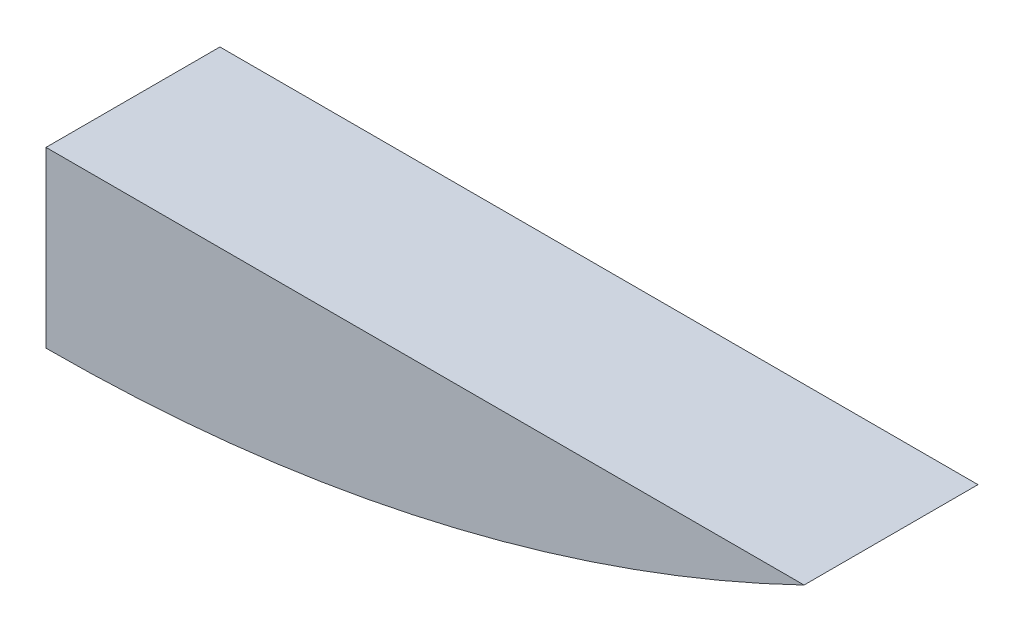
ISO-10303-21;
HEADER;
FILE_DESCRIPTION(('STEP AP214'),'2;1');
FILE_NAME('part.step','',(''),(''),'','','');
FILE_SCHEMA(('AUTOMOTIVE_DESIGN { 1 0 10303 214 1 1 1 1 }'));
ENDSEC;
DATA;
#1=APPLICATION_CONTEXT('core data for automotive mechanical design processes');
#2=APPLICATION_PROTOCOL_DEFINITION('international standard','automotive_design',2000,#1);
#3=PRODUCT_CONTEXT('',#1,'mechanical');
#4=PRODUCT('Part','Part','',(#3));
#5=PRODUCT_RELATED_PRODUCT_CATEGORY('part','',(#4));
#6=PRODUCT_DEFINITION_FORMATION('','',#4);
#7=PRODUCT_DEFINITION_CONTEXT('part definition',#1,'design');
#8=PRODUCT_DEFINITION('design','',#6,#7);
#9=PRODUCT_DEFINITION_SHAPE('','',#8);
#10=(LENGTH_UNIT() NAMED_UNIT(*) SI_UNIT(.MILLI.,.METRE.));
#11=(NAMED_UNIT(*) PLANE_ANGLE_UNIT() SI_UNIT($,.RADIAN.));
#12=(NAMED_UNIT(*) SI_UNIT($,.STERADIAN.) SOLID_ANGLE_UNIT());
#13=UNCERTAINTY_MEASURE_WITH_UNIT(LENGTH_MEASURE(1.E-05),#10,'distance_accuracy_value','');
#14=(GEOMETRIC_REPRESENTATION_CONTEXT(3) GLOBAL_UNCERTAINTY_ASSIGNED_CONTEXT((#13)) GLOBAL_UNIT_ASSIGNED_CONTEXT((#10,
#11,#12)) REPRESENTATION_CONTEXT('',''));
#15=CARTESIAN_POINT('',(0.,0.,0.));
#16=DIRECTION('',(0.,0.,1.));
#17=DIRECTION('',(1.,0.,0.));
#18=AXIS2_PLACEMENT_3D('',#15,#16,#17);
#19=CARTESIAN_POINT('',(0.,-45.,0.));
#20=DIRECTION('',(0.,1.,0.));
#21=DIRECTION('',(0.,0.,1.));
#22=AXIS2_PLACEMENT_3D('',#19,#20,#21);
#23=PLANE('',#22);
#24=DIRECTION('',(0.,0.,1.));
#25=VECTOR('',#24,1.);
#26=CARTESIAN_POINT('',(597.266258042068,-45.,0.));
#27=LINE('',#26,#25);
#28=CARTESIAN_POINT('',(597.266258042068,-45.,0.));
#29=VERTEX_POINT('',#28);
#30=CARTESIAN_POINT('',(597.266258042068,-45.,5.));
#31=VERTEX_POINT('',#30);
#32=EDGE_CURVE('E74',#29,#31,#27,.T.);
#33=ORIENTED_EDGE('',*,*,#32,.T.);
#34=DIRECTION('',(-1.,0.,0.));
#35=VECTOR('',#34,1.);
#36=CARTESIAN_POINT('',(597.266258042068,-45.,5.));
#37=LINE('',#36,#35);
#38=CARTESIAN_POINT('',(619.060752759772,-45.,5.));
#39=VERTEX_POINT('',#38);
#40=EDGE_CURVE('E38',#39,#31,#37,.T.);
#41=ORIENTED_EDGE('',*,*,#40,.F.);
#42=DIRECTION('',(0.,0.,-1.));
#43=VECTOR('',#42,1.);
#44=CARTESIAN_POINT('',(619.060752759772,-45.,80.));
#45=LINE('',#44,#43);
#46=CARTESIAN_POINT('',(619.060752759772,-45.,0.));
#47=VERTEX_POINT('',#46);
#48=EDGE_CURVE('E82',#39,#47,#45,.T.);
#49=ORIENTED_EDGE('',*,*,#48,.T.);
#50=DIRECTION('',(-1.,0.,0.));
#51=VECTOR('',#50,1.);
#52=CARTESIAN_POINT('',(-502.733741957931,-45.,0.));
#53=LINE('',#52,#51);
#54=EDGE_CURVE('E84',#47,#29,#53,.T.);
#55=ORIENTED_EDGE('',*,*,#54,.T.);
#56=EDGE_LOOP('',(#33,#41,#49,#55));
#57=FACE_BOUND('',#56,.T.);
#58=ADVANCED_FACE('F34',(#57),#23,.T.);
#59=CARTESIAN_POINT('',(597.266258042068,0.,80.));
#60=DIRECTION('',(0.,0.,-1.));
#61=DIRECTION('',(-1.,0.,0.));
#62=AXIS2_PLACEMENT_3D('',#59,#60,#61);
#63=CYLINDRICAL_SURFACE('',#62,50.);
#64=ORIENTED_EDGE('',*,*,#48,.F.);
#65=CARTESIAN_POINT('',(597.266258042068,0.,5.));
#66=DIRECTION('',(0.,0.,1.));
#67=DIRECTION('',(1.,0.,0.));
#68=AXIS2_PLACEMENT_3D('',#65,#66,#67);
#69=CIRCLE('',#68,50.);
#70=CARTESIAN_POINT('',(597.266258042068,-50.,5.));
#71=VERTEX_POINT('',#70);
#72=EDGE_CURVE('E11',#71,#39,#69,.T.);
#73=ORIENTED_EDGE('',*,*,#72,.F.);
#74=DIRECTION('',(0.,0.,-1.));
#75=VECTOR('',#74,1.);
#76=CARTESIAN_POINT('',(597.266258042068,-50.,80.));
#77=LINE('',#76,#75);
#78=CARTESIAN_POINT('',(597.266258042068,-50.,0.));
#79=VERTEX_POINT('',#78);
#80=EDGE_CURVE('E75',#71,#79,#77,.T.);
#81=ORIENTED_EDGE('',*,*,#80,.T.);
#82=CARTESIAN_POINT('',(597.266258042068,0.,0.));
#83=DIRECTION('',(0.,0.,1.));
#84=DIRECTION('',(1.,0.,0.));
#85=AXIS2_PLACEMENT_3D('',#82,#83,#84);
#86=CIRCLE('',#85,50.);
#87=EDGE_CURVE('E43',#79,#47,#86,.T.);
#88=ORIENTED_EDGE('',*,*,#87,.T.);
#89=EDGE_LOOP('',(#64,#73,#81,#88));
#90=FACE_BOUND('',#89,.T.);
#91=ADVANCED_FACE('F90',(#90),#63,.T.);
#92=CARTESIAN_POINT('',(-502.733741957931,0.,0.));
#93=DIRECTION('',(0.,0.,1.));
#94=DIRECTION('',(1.,0.,0.));
#95=AXIS2_PLACEMENT_3D('',#92,#93,#94);
#96=PLANE('',#95);
#97=ORIENTED_EDGE('',*,*,#54,.F.);
#98=ORIENTED_EDGE('',*,*,#87,.F.);
#99=DIRECTION('',(0.,-1.,0.));
#100=VECTOR('',#99,1.);
#101=CARTESIAN_POINT('',(597.266258042068,0.,0.));
#102=LINE('',#101,#100);
#103=EDGE_CURVE('E77',#29,#79,#102,.T.);
#104=ORIENTED_EDGE('',*,*,#103,.F.);
#105=EDGE_LOOP('',(#97,#98,#104));
#106=FACE_BOUND('',#105,.T.);
#107=ADVANCED_FACE('F36',(#106),#96,.F.);
#108=CARTESIAN_POINT('',(597.266258042068,-45.,5.));
#109=DIRECTION('',(0.,0.,1.));
#110=DIRECTION('',(1.,0.,0.));
#111=AXIS2_PLACEMENT_3D('',#108,#109,#110);
#112=PLANE('',#111);
#113=ORIENTED_EDGE('',*,*,#72,.T.);
#114=ORIENTED_EDGE('',*,*,#40,.T.);
#115=DIRECTION('',(0.,-1.,0.));
#116=VECTOR('',#115,1.);
#117=CARTESIAN_POINT('',(597.266258042068,-45.,5.));
#118=LINE('',#117,#116);
#119=EDGE_CURVE('E69',#31,#71,#118,.T.);
#120=ORIENTED_EDGE('',*,*,#119,.T.);
#121=EDGE_LOOP('',(#113,#114,#120));
#122=FACE_BOUND('',#121,.T.);
#123=ADVANCED_FACE('F79',(#122),#112,.T.);
#124=CARTESIAN_POINT('',(597.266258042068,0.,0.));
#125=DIRECTION('',(-1.,0.,0.));
#126=DIRECTION('',(0.,0.,1.));
#127=AXIS2_PLACEMENT_3D('',#124,#125,#126);
#128=PLANE('',#127);
#129=ORIENTED_EDGE('',*,*,#32,.F.);
#130=ORIENTED_EDGE('',*,*,#103,.T.);
#131=ORIENTED_EDGE('',*,*,#80,.F.);
#132=ORIENTED_EDGE('',*,*,#119,.F.);
#133=EDGE_LOOP('',(#129,#130,#131,#132));
#134=FACE_BOUND('',#133,.T.);
#135=ADVANCED_FACE('F71',(#134),#128,.T.);
#136=CLOSED_SHELL('',(#58,#91,#107,#123,#135));
#137=MANIFOLD_SOLID_BREP('B2',#136);
#138=ADVANCED_BREP_SHAPE_REPRESENTATION('',(#18,#137),#14);
#139=SHAPE_DEFINITION_REPRESENTATION(#9,#138);
ENDSEC;
END-ISO-10303-21;
